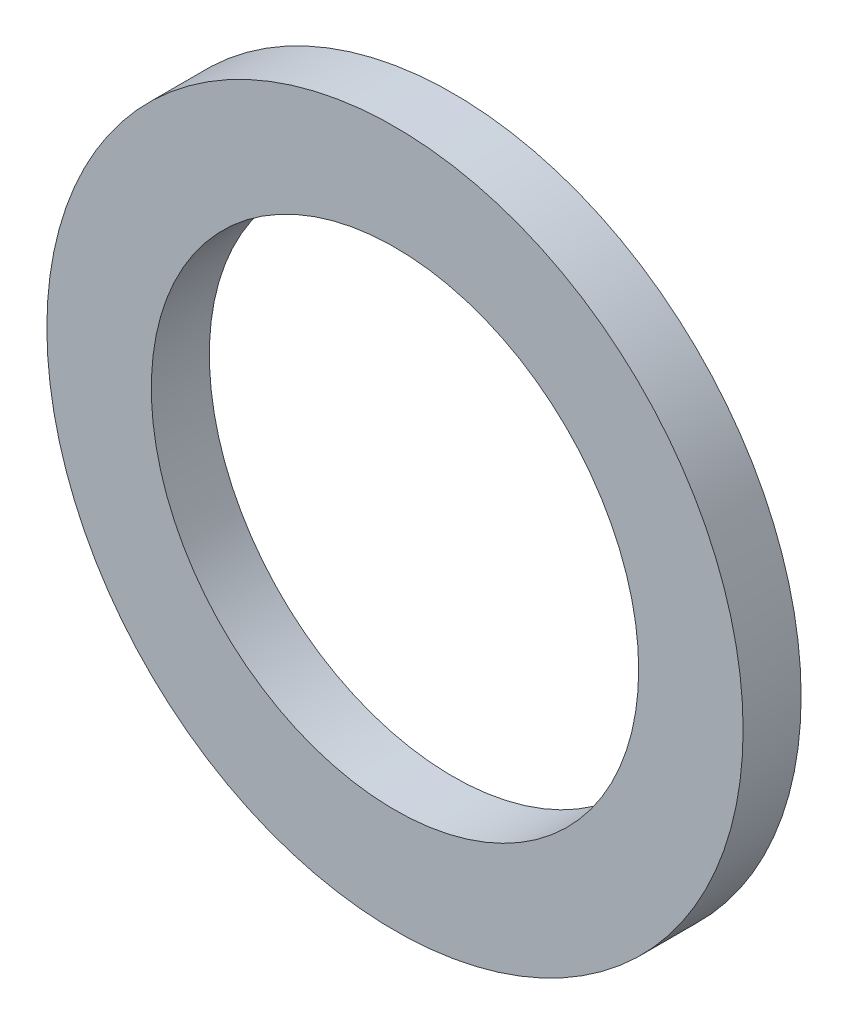
ISO-10303-21;
HEADER;
FILE_DESCRIPTION(('STEP AP214'),'2;1');
FILE_NAME('part.step','',(''),(''),'','','');
FILE_SCHEMA(('AUTOMOTIVE_DESIGN { 1 0 10303 214 1 1 1 1 }'));
ENDSEC;
DATA;
#1=APPLICATION_CONTEXT('core data for automotive mechanical design processes');
#2=APPLICATION_PROTOCOL_DEFINITION('international standard','automotive_design',2000,#1);
#3=PRODUCT_CONTEXT('',#1,'mechanical');
#4=PRODUCT('Part','Part','',(#3));
#5=PRODUCT_RELATED_PRODUCT_CATEGORY('part','',(#4));
#6=PRODUCT_DEFINITION_FORMATION('','',#4);
#7=PRODUCT_DEFINITION_CONTEXT('part definition',#1,'design');
#8=PRODUCT_DEFINITION('design','',#6,#7);
#9=PRODUCT_DEFINITION_SHAPE('','',#8);
#10=(LENGTH_UNIT() NAMED_UNIT(*) SI_UNIT(.MILLI.,.METRE.));
#11=(NAMED_UNIT(*) PLANE_ANGLE_UNIT() SI_UNIT($,.RADIAN.));
#12=(NAMED_UNIT(*) SI_UNIT($,.STERADIAN.) SOLID_ANGLE_UNIT());
#13=UNCERTAINTY_MEASURE_WITH_UNIT(LENGTH_MEASURE(1.E-05),#10,'distance_accuracy_value','');
#14=(GEOMETRIC_REPRESENTATION_CONTEXT(3) GLOBAL_UNCERTAINTY_ASSIGNED_CONTEXT((#13)) GLOBAL_UNIT_ASSIGNED_CONTEXT((#10,
#11,#12)) REPRESENTATION_CONTEXT('',''));
#15=CARTESIAN_POINT('',(0.,0.,0.));
#16=DIRECTION('',(0.,0.,1.));
#17=DIRECTION('',(1.,0.,0.));
#18=AXIS2_PLACEMENT_3D('',#15,#16,#17);
#19=CARTESIAN_POINT('',(0.,0.,0.5));
#20=DIRECTION('',(0.,0.,1.));
#21=DIRECTION('',(1.,0.,0.));
#22=AXIS2_PLACEMENT_3D('',#19,#20,#21);
#23=PLANE('',#22);
#24=CARTESIAN_POINT('',(0.,0.,0.5));
#25=DIRECTION('',(0.,0.,1.));
#26=DIRECTION('',(1.,0.,0.));
#27=AXIS2_PLACEMENT_3D('',#24,#25,#26);
#28=CIRCLE('',#27,6.);
#29=CARTESIAN_POINT('',(6.00000000000001,0.,0.500000000000001));
#30=VERTEX_POINT('',#29);
#31=EDGE_CURVE('E10',#30,#30,#28,.T.);
#32=ORIENTED_EDGE('',*,*,#31,.T.);
#33=EDGE_LOOP('',(#32));
#34=FACE_BOUND('',#33,.T.);
#35=CARTESIAN_POINT('',(0.,0.,0.5));
#36=DIRECTION('',(0.,0.,1.));
#37=DIRECTION('',(1.,0.,0.));
#38=AXIS2_PLACEMENT_3D('',#35,#36,#37);
#39=CIRCLE('',#38,4.2);
#40=CARTESIAN_POINT('',(4.20000000000001,0.,0.500000000000001));
#41=VERTEX_POINT('',#40);
#42=EDGE_CURVE('E35',#41,#41,#39,.T.);
#43=ORIENTED_EDGE('',*,*,#42,.F.);
#44=EDGE_LOOP('',(#43));
#45=FACE_BOUND('',#44,.T.);
#46=ADVANCED_FACE('F24',(#34,#45),#23,.T.);
#47=CARTESIAN_POINT('',(0.,0.,-0.500000000000084));
#48=DIRECTION('',(0.,0.,1.));
#49=DIRECTION('',(1.,0.,0.));
#50=AXIS2_PLACEMENT_3D('',#47,#48,#49);
#51=PLANE('',#50);
#52=CARTESIAN_POINT('',(0.,0.,-0.500000000000084));
#53=DIRECTION('',(0.,0.,1.));
#54=DIRECTION('',(1.,0.,0.));
#55=AXIS2_PLACEMENT_3D('',#52,#53,#54);
#56=CIRCLE('',#55,6.);
#57=CARTESIAN_POINT('',(6.00000000000001,0.,-0.500000000000083));
#58=VERTEX_POINT('',#57);
#59=EDGE_CURVE('E31',#58,#58,#56,.T.);
#60=ORIENTED_EDGE('',*,*,#59,.F.);
#61=EDGE_LOOP('',(#60));
#62=FACE_BOUND('',#61,.T.);
#63=CARTESIAN_POINT('',(0.,0.,-0.500000000000084));
#64=DIRECTION('',(0.,0.,1.));
#65=DIRECTION('',(1.,0.,0.));
#66=AXIS2_PLACEMENT_3D('',#63,#64,#65);
#67=CIRCLE('',#66,4.2);
#68=CARTESIAN_POINT('',(4.20000000000001,0.,-0.500000000000084));
#69=VERTEX_POINT('',#68);
#70=EDGE_CURVE('E39',#69,#69,#67,.T.);
#71=ORIENTED_EDGE('',*,*,#70,.T.);
#72=EDGE_LOOP('',(#71));
#73=FACE_BOUND('',#72,.T.);
#74=ADVANCED_FACE('F45',(#62,#73),#51,.F.);
#75=CARTESIAN_POINT('',(0.,0.,0.5));
#76=DIRECTION('',(0.,0.,-1.));
#77=DIRECTION('',(-1.,0.,0.));
#78=AXIS2_PLACEMENT_3D('',#75,#76,#77);
#79=CYLINDRICAL_SURFACE('',#78,6.);
#80=ORIENTED_EDGE('',*,*,#31,.F.);
#81=EDGE_LOOP('',(#80));
#82=FACE_BOUND('',#81,.T.);
#83=ORIENTED_EDGE('',*,*,#59,.T.);
#84=EDGE_LOOP('',(#83));
#85=FACE_BOUND('',#84,.T.);
#86=ADVANCED_FACE('F26',(#82,#85),#79,.T.);
#87=CARTESIAN_POINT('',(0.,0.,0.5));
#88=DIRECTION('',(0.,0.,-1.));
#89=DIRECTION('',(-1.,0.,0.));
#90=AXIS2_PLACEMENT_3D('',#87,#88,#89);
#91=CYLINDRICAL_SURFACE('',#90,4.2);
#92=ORIENTED_EDGE('',*,*,#42,.T.);
#93=EDGE_LOOP('',(#92));
#94=FACE_BOUND('',#93,.T.);
#95=ORIENTED_EDGE('',*,*,#70,.F.);
#96=EDGE_LOOP('',(#95));
#97=FACE_BOUND('',#96,.T.);
#98=ADVANCED_FACE('F47',(#94,#97),#91,.F.);
#99=CLOSED_SHELL('',(#46,#74,#86,#98));
#100=MANIFOLD_SOLID_BREP('B2',#99);
#101=ADVANCED_BREP_SHAPE_REPRESENTATION('',(#18,#100),#14);
#102=SHAPE_DEFINITION_REPRESENTATION(#9,#101);
ENDSEC;
END-ISO-10303-21;
